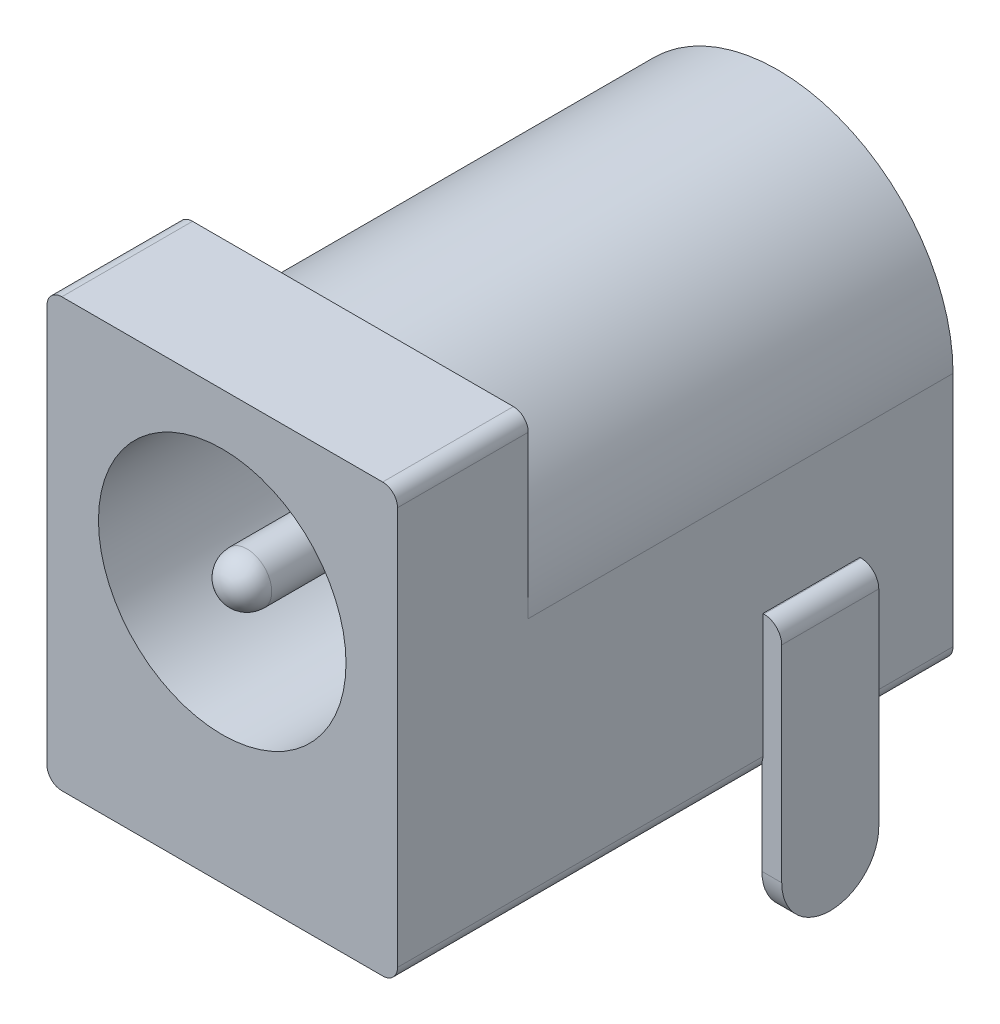
ISO-10303-21;
HEADER;
FILE_DESCRIPTION(('STEP AP214'),'2;1');
FILE_NAME('part.step','',(''),(''),'','','');
FILE_SCHEMA(('AUTOMOTIVE_DESIGN { 1 0 10303 214 1 1 1 1 }'));
ENDSEC;
DATA;
#1=APPLICATION_CONTEXT('core data for automotive mechanical design processes');
#2=APPLICATION_PROTOCOL_DEFINITION('international standard','automotive_design',2000,#1);
#3=PRODUCT_CONTEXT('',#1,'mechanical');
#4=PRODUCT('Part','Part','',(#3));
#5=PRODUCT_RELATED_PRODUCT_CATEGORY('part','',(#4));
#6=PRODUCT_DEFINITION_FORMATION('','',#4);
#7=PRODUCT_DEFINITION_CONTEXT('part definition',#1,'design');
#8=PRODUCT_DEFINITION('design','',#6,#7);
#9=PRODUCT_DEFINITION_SHAPE('','',#8);
#10=(LENGTH_UNIT() NAMED_UNIT(*) SI_UNIT(.MILLI.,.METRE.));
#11=(NAMED_UNIT(*) PLANE_ANGLE_UNIT() SI_UNIT($,.RADIAN.));
#12=(NAMED_UNIT(*) SI_UNIT($,.STERADIAN.) SOLID_ANGLE_UNIT());
#13=UNCERTAINTY_MEASURE_WITH_UNIT(LENGTH_MEASURE(1.E-05),#10,'distance_accuracy_value','');
#14=(GEOMETRIC_REPRESENTATION_CONTEXT(3) GLOBAL_UNCERTAINTY_ASSIGNED_CONTEXT((#13)) GLOBAL_UNIT_ASSIGNED_CONTEXT((#10,
#11,#12)) REPRESENTATION_CONTEXT('',''));
#15=CARTESIAN_POINT('',(0.,0.,0.));
#16=DIRECTION('',(0.,0.,1.));
#17=DIRECTION('',(1.,0.,0.));
#18=AXIS2_PLACEMENT_3D('',#15,#16,#17);
#19=CARTESIAN_POINT('',(8.9662,-3.683,2.3876));
#20=DIRECTION('',(-1.,0.,0.));
#21=DIRECTION('',(0.,0.,1.));
#22=AXIS2_PLACEMENT_3D('',#19,#20,#21);
#23=PLANE('',#22);
#24=DIRECTION('',(0.,1.,0.));
#25=VECTOR('',#24,1.);
#26=CARTESIAN_POINT('',(8.9662,-3.683,2.3876));
#27=LINE('',#26,#25);
#28=CARTESIAN_POINT('',(8.96619999999999,-2.1844,2.3876));
#29=VERTEX_POINT('',#28);
#30=CARTESIAN_POINT('',(8.9662,0.244216813898783,2.3876));
#31=VERTEX_POINT('',#30);
#32=EDGE_CURVE('E224',#29,#31,#27,.T.);
#33=ORIENTED_EDGE('',*,*,#32,.F.);
#34=CARTESIAN_POINT('',(8.96619999999999,-2.1844,3.6322));
#35=DIRECTION('',(1.,0.,0.));
#36=DIRECTION('',(0.,0.,-1.));
#37=AXIS2_PLACEMENT_3D('',#34,#35,#36);
#38=CIRCLE('',#37,1.2446);
#39=CARTESIAN_POINT('',(8.96619999999999,-2.1844,4.8768));
#40=VERTEX_POINT('',#39);
#41=EDGE_CURVE('E211',#40,#29,#38,.T.);
#42=ORIENTED_EDGE('',*,*,#41,.F.);
#43=DIRECTION('',(0.,1.,0.));
#44=VECTOR('',#43,1.);
#45=CARTESIAN_POINT('',(8.9662,-3.683,4.8768));
#46=LINE('',#45,#44);
#47=CARTESIAN_POINT('',(8.9662,0.244216813898783,4.8768));
#48=VERTEX_POINT('',#47);
#49=EDGE_CURVE('E244',#40,#48,#46,.T.);
#50=ORIENTED_EDGE('',*,*,#49,.T.);
#51=DIRECTION('',(0.,0.,-1.));
#52=VECTOR('',#51,1.);
#53=CARTESIAN_POINT('',(8.9662,0.244216813898783,14.2494));
#54=LINE('',#53,#52);
#55=EDGE_CURVE('E231',#31,#48,#54,.F.);
#56=ORIENTED_EDGE('',*,*,#55,.F.);
#57=EDGE_LOOP('',(#33,#42,#50,#56));
#58=FACE_BOUND('',#57,.T.);
#59=ADVANCED_FACE('F35',(#58),#23,.T.);
#60=CARTESIAN_POINT('',(8.9662,-3.683,2.3876));
#61=DIRECTION('',(0.,0.,1.));
#62=DIRECTION('',(1.,0.,0.));
#63=AXIS2_PLACEMENT_3D('',#60,#61,#62);
#64=PLANE('',#63);
#65=DIRECTION('',(1.,0.,0.));
#66=VECTOR('',#65,1.);
#67=CARTESIAN_POINT('',(8.96619999999999,-2.1844,2.3876));
#68=LINE('',#67,#66);
#69=CARTESIAN_POINT('',(9.47419999999999,-2.1844,2.3876));
#70=VERTEX_POINT('',#69);
#71=EDGE_CURVE('E50',#29,#70,#68,.T.);
#72=ORIENTED_EDGE('',*,*,#71,.F.);
#73=ORIENTED_EDGE('',*,*,#32,.T.);
#74=CARTESIAN_POINT('',(8.6106,0.380999999999999,2.3876));
#75=DIRECTION('',(0.,0.,1.));
#76=DIRECTION('',(1.,0.,0.));
#77=AXIS2_PLACEMENT_3D('',#74,#75,#76);
#78=CIRCLE('',#77,0.380999999999999);
#79=CARTESIAN_POINT('',(8.99159999999999,0.380999999999999,2.3876));
#80=VERTEX_POINT('',#79);
#81=EDGE_CURVE('E235',#31,#80,#78,.T.);
#82=ORIENTED_EDGE('',*,*,#81,.T.);
#83=DIRECTION('',(0.,-1.,0.));
#84=VECTOR('',#83,1.);
#85=CARTESIAN_POINT('',(8.9916,10.5918,2.3876));
#86=LINE('',#85,#84);
#87=CARTESIAN_POINT('',(8.9916,3.556,2.3876));
#88=VERTEX_POINT('',#87);
#89=EDGE_CURVE('E342',#88,#80,#86,.T.);
#90=ORIENTED_EDGE('',*,*,#89,.F.);
#91=DIRECTION('',(1.,0.,0.));
#92=VECTOR('',#91,1.);
#93=CARTESIAN_POINT('',(8.9662,3.556,2.3876));
#94=LINE('',#93,#92);
#95=CARTESIAN_POINT('',(9.017,3.556,2.3876));
#96=VERTEX_POINT('',#95);
#97=EDGE_CURVE('E240',#88,#96,#94,.T.);
#98=ORIENTED_EDGE('',*,*,#97,.T.);
#99=CARTESIAN_POINT('',(9.017,3.0988,2.3876));
#100=DIRECTION('',(0.,0.,1.));
#101=DIRECTION('',(1.,0.,0.));
#102=AXIS2_PLACEMENT_3D('',#99,#100,#101);
#103=CIRCLE('',#102,0.4572);
#104=CARTESIAN_POINT('',(9.47419999999999,3.0988,2.3876));
#105=VERTEX_POINT('',#104);
#106=EDGE_CURVE('E378',#96,#105,#103,.F.);
#107=ORIENTED_EDGE('',*,*,#106,.T.);
#108=DIRECTION('',(0.,1.,0.));
#109=VECTOR('',#108,1.);
#110=CARTESIAN_POINT('',(9.47419999999999,-3.683,2.3876));
#111=LINE('',#110,#109);
#112=EDGE_CURVE('E227',#70,#105,#111,.T.);
#113=ORIENTED_EDGE('',*,*,#112,.F.);
#114=EDGE_LOOP('',(#72,#73,#82,#90,#98,#107,#113));
#115=FACE_BOUND('',#114,.T.);
#116=ADVANCED_FACE('F222',(#115),#64,.F.);
#117=CARTESIAN_POINT('',(9.47419999999999,-3.683,4.8768));
#118=DIRECTION('',(1.,0.,0.));
#119=DIRECTION('',(0.,0.,-1.));
#120=AXIS2_PLACEMENT_3D('',#117,#118,#119);
#121=PLANE('',#120);
#122=DIRECTION('',(0.,1.,0.));
#123=VECTOR('',#122,1.);
#124=CARTESIAN_POINT('',(9.47419999999999,-3.683,4.8768));
#125=LINE('',#124,#123);
#126=CARTESIAN_POINT('',(9.47419999999999,-2.1844,4.8768));
#127=VERTEX_POINT('',#126);
#128=CARTESIAN_POINT('',(9.47419999999999,3.0988,4.8768));
#129=VERTEX_POINT('',#128);
#130=EDGE_CURVE('E237',#127,#129,#125,.T.);
#131=ORIENTED_EDGE('',*,*,#130,.F.);
#132=CARTESIAN_POINT('',(9.47419999999999,-2.1844,3.6322));
#133=DIRECTION('',(1.,0.,0.));
#134=DIRECTION('',(0.,0.,-1.));
#135=AXIS2_PLACEMENT_3D('',#132,#133,#134);
#136=CIRCLE('',#135,1.2446);
#137=EDGE_CURVE('E218',#127,#70,#136,.T.);
#138=ORIENTED_EDGE('',*,*,#137,.T.);
#139=ORIENTED_EDGE('',*,*,#112,.T.);
#140=DIRECTION('',(0.,0.,-1.));
#141=VECTOR('',#140,1.);
#142=CARTESIAN_POINT('',(9.47419999999999,3.0988,4.8768));
#143=LINE('',#142,#141);
#144=EDGE_CURVE('E380',#105,#129,#143,.F.);
#145=ORIENTED_EDGE('',*,*,#144,.T.);
#146=EDGE_LOOP('',(#131,#138,#139,#145));
#147=FACE_BOUND('',#146,.T.);
#148=ADVANCED_FACE('F439',(#147),#121,.T.);
#149=CARTESIAN_POINT('',(5.7404,-3.683,7.0104));
#150=DIRECTION('',(1.,0.,0.));
#151=DIRECTION('',(0.,0.,-1.));
#152=AXIS2_PLACEMENT_3D('',#149,#150,#151);
#153=PLANE('',#152);
#154=DIRECTION('',(0.,1.,0.));
#155=VECTOR('',#154,1.);
#156=CARTESIAN_POINT('',(5.7404,-3.683,7.0104));
#157=LINE('',#156,#155);
#158=CARTESIAN_POINT('',(5.7404,-2.1844,7.0104));
#159=VERTEX_POINT('',#158);
#160=CARTESIAN_POINT('',(5.7404,0.,7.0104));
#161=VERTEX_POINT('',#160);
#162=EDGE_CURVE('E469',#159,#161,#157,.T.);
#163=ORIENTED_EDGE('',*,*,#162,.F.);
#164=DIRECTION('',(0.,0.,-1.));
#165=VECTOR('',#164,1.);
#166=CARTESIAN_POINT('',(5.7404,-2.1844,7.26440000002886));
#167=LINE('',#166,#165);
#168=CARTESIAN_POINT('',(5.7404,-2.1844,6.75640000002886));
#169=VERTEX_POINT('',#168);
#170=EDGE_CURVE('E57',#159,#169,#167,.T.);
#171=ORIENTED_EDGE('',*,*,#170,.T.);
#172=DIRECTION('',(0.,1.,0.));
#173=VECTOR('',#172,1.);
#174=CARTESIAN_POINT('',(5.7404,-3.683,6.7564));
#175=LINE('',#174,#173);
#176=CARTESIAN_POINT('',(5.7404,0.,6.7564));
#177=VERTEX_POINT('',#176);
#178=EDGE_CURVE('E467',#169,#177,#175,.T.);
#179=ORIENTED_EDGE('',*,*,#178,.T.);
#180=DIRECTION('',(0.,0.,-1.));
#181=VECTOR('',#180,1.);
#182=CARTESIAN_POINT('',(5.74040000000005,0.,14.2494));
#183=LINE('',#182,#181);
#184=EDGE_CURVE('E369',#161,#177,#183,.T.);
#185=ORIENTED_EDGE('',*,*,#184,.F.);
#186=EDGE_LOOP('',(#163,#171,#179,#185));
#187=FACE_BOUND('',#186,.T.);
#188=ADVANCED_FACE('F601',(#187),#153,.T.);
#189=CARTESIAN_POINT('',(3.2512,-3.683,6.7564));
#190=DIRECTION('',(0.,0.,1.));
#191=DIRECTION('',(1.,0.,0.));
#192=AXIS2_PLACEMENT_3D('',#189,#190,#191);
#193=PLANE('',#192);
#194=CARTESIAN_POINT('',(4.4958,-2.1844,6.75640000002886));
#195=DIRECTION('',(0.,0.,-1.));
#196=DIRECTION('',(-1.,0.,0.));
#197=AXIS2_PLACEMENT_3D('',#194,#195,#196);
#198=CIRCLE('',#197,1.2446);
#199=CARTESIAN_POINT('',(3.2512,-2.1844,6.75640000002886));
#200=VERTEX_POINT('',#199);
#201=EDGE_CURVE('E436',#169,#200,#198,.T.);
#202=ORIENTED_EDGE('',*,*,#201,.T.);
#203=DIRECTION('',(0.,1.,0.));
#204=VECTOR('',#203,1.);
#205=CARTESIAN_POINT('',(3.2512,-3.683,6.7564));
#206=LINE('',#205,#204);
#207=CARTESIAN_POINT('',(3.2512,0.,6.7564));
#208=VERTEX_POINT('',#207);
#209=EDGE_CURVE('E464',#200,#208,#206,.T.);
#210=ORIENTED_EDGE('',*,*,#209,.T.);
#211=DIRECTION('',(1.,0.,0.));
#212=VECTOR('',#211,1.);
#213=CARTESIAN_POINT('',(0.381,0.,6.7564));
#214=LINE('',#213,#212);
#215=EDGE_CURVE('E474',#208,#177,#214,.T.);
#216=ORIENTED_EDGE('',*,*,#215,.T.);
#217=ORIENTED_EDGE('',*,*,#178,.F.);
#218=EDGE_LOOP('',(#202,#210,#216,#217));
#219=FACE_BOUND('',#218,.T.);
#220=ADVANCED_FACE('F590',(#219),#193,.F.);
#221=CARTESIAN_POINT('',(5.7404,-3.683,7.0104));
#222=DIRECTION('',(0.,0.,-1.));
#223=DIRECTION('',(-1.,0.,0.));
#224=AXIS2_PLACEMENT_3D('',#221,#222,#223);
#225=PLANE('',#224);
#226=CARTESIAN_POINT('',(4.4958,-2.1844,7.0104));
#227=DIRECTION('',(0.,0.,-1.));
#228=DIRECTION('',(-1.,0.,0.));
#229=AXIS2_PLACEMENT_3D('',#226,#227,#228);
#230=CIRCLE('',#229,1.2446);
#231=CARTESIAN_POINT('',(3.2512,-2.1844,7.0104));
#232=VERTEX_POINT('',#231);
#233=EDGE_CURVE('E12',#159,#232,#230,.T.);
#234=ORIENTED_EDGE('',*,*,#233,.F.);
#235=ORIENTED_EDGE('',*,*,#162,.T.);
#236=DIRECTION('',(-1.,0.,0.));
#237=VECTOR('',#236,1.);
#238=CARTESIAN_POINT('',(0.381,0.,7.0104));
#239=LINE('',#238,#237);
#240=CARTESIAN_POINT('',(3.2512,0.,7.0104));
#241=VERTEX_POINT('',#240);
#242=EDGE_CURVE('E466',#161,#241,#239,.T.);
#243=ORIENTED_EDGE('',*,*,#242,.T.);
#244=DIRECTION('',(0.,1.,0.));
#245=VECTOR('',#244,1.);
#246=CARTESIAN_POINT('',(3.2512,-3.683,7.0104));
#247=LINE('',#246,#245);
#248=EDGE_CURVE('E463',#232,#241,#247,.T.);
#249=ORIENTED_EDGE('',*,*,#248,.F.);
#250=EDGE_LOOP('',(#234,#235,#243,#249));
#251=FACE_BOUND('',#250,.T.);
#252=ADVANCED_FACE('F598',(#251),#225,.F.);
#253=CARTESIAN_POINT('',(2.9972,-3.683,0.381000000000002));
#254=DIRECTION('',(0.,0.,1.));
#255=DIRECTION('',(1.,0.,0.));
#256=AXIS2_PLACEMENT_3D('',#253,#254,#255);
#257=PLANE('',#256);
#258=CARTESIAN_POINT('',(4.4958,-1.9304,0.381000000000002));
#259=DIRECTION('',(0.,0.,-1.));
#260=DIRECTION('',(-1.,0.,0.));
#261=AXIS2_PLACEMENT_3D('',#258,#259,#260);
#262=CIRCLE('',#261,1.4986);
#263=CARTESIAN_POINT('',(5.9944,-1.9304,0.381000000000002));
#264=VERTEX_POINT('',#263);
#265=CARTESIAN_POINT('',(2.9972,-1.9304,0.381000000000002));
#266=VERTEX_POINT('',#265);
#267=EDGE_CURVE('E447',#264,#266,#262,.T.);
#268=ORIENTED_EDGE('',*,*,#267,.T.);
#269=DIRECTION('',(0.,1.,0.));
#270=VECTOR('',#269,1.);
#271=CARTESIAN_POINT('',(2.9972,-3.683,0.381000000000002));
#272=LINE('',#271,#270);
#273=CARTESIAN_POINT('',(2.9972,0.,0.381000000000002));
#274=VERTEX_POINT('',#273);
#275=EDGE_CURVE('E396',#266,#274,#272,.T.);
#276=ORIENTED_EDGE('',*,*,#275,.T.);
#277=DIRECTION('',(1.,0.,0.));
#278=VECTOR('',#277,1.);
#279=CARTESIAN_POINT('',(0.381,0.,0.381000000000002));
#280=LINE('',#279,#278);
#281=CARTESIAN_POINT('',(5.9944,0.,0.381000000000002));
#282=VERTEX_POINT('',#281);
#283=EDGE_CURVE('E351',#274,#282,#280,.T.);
#284=ORIENTED_EDGE('',*,*,#283,.T.);
#285=DIRECTION('',(0.,1.,0.));
#286=VECTOR('',#285,1.);
#287=CARTESIAN_POINT('',(5.9944,-3.683,0.381000000000002));
#288=LINE('',#287,#286);
#289=EDGE_CURVE('E479',#264,#282,#288,.T.);
#290=ORIENTED_EDGE('',*,*,#289,.F.);
#291=EDGE_LOOP('',(#268,#276,#284,#290));
#292=FACE_BOUND('',#291,.T.);
#293=ADVANCED_FACE('F503',(#292),#257,.F.);
#294=CARTESIAN_POINT('',(5.9944,-3.683,0.889000000000002));
#295=DIRECTION('',(1.,0.,0.));
#296=DIRECTION('',(0.,0.,-1.));
#297=AXIS2_PLACEMENT_3D('',#294,#295,#296);
#298=PLANE('',#297);
#299=DIRECTION('',(0.,1.,0.));
#300=VECTOR('',#299,1.);
#301=CARTESIAN_POINT('',(5.9944,-3.683,0.889000000000002));
#302=LINE('',#301,#300);
#303=CARTESIAN_POINT('',(5.9944,-1.9304,0.889000000000002));
#304=VERTEX_POINT('',#303);
#305=CARTESIAN_POINT('',(5.9944,0.,0.889000000000002));
#306=VERTEX_POINT('',#305);
#307=EDGE_CURVE('E481',#304,#306,#302,.T.);
#308=ORIENTED_EDGE('',*,*,#307,.F.);
#309=DIRECTION('',(0.,0.,-1.));
#310=VECTOR('',#309,1.);
#311=CARTESIAN_POINT('',(5.9944,-1.9304,0.889000000000003));
#312=LINE('',#311,#310);
#313=EDGE_CURVE('E450',#304,#264,#312,.T.);
#314=ORIENTED_EDGE('',*,*,#313,.T.);
#315=ORIENTED_EDGE('',*,*,#289,.T.);
#316=DIRECTION('',(0.,0.,-1.));
#317=VECTOR('',#316,1.);
#318=CARTESIAN_POINT('',(5.9944,0.,14.2494));
#319=LINE('',#318,#317);
#320=EDGE_CURVE('E348',#306,#282,#319,.T.);
#321=ORIENTED_EDGE('',*,*,#320,.F.);
#322=EDGE_LOOP('',(#308,#314,#315,#321));
#323=FACE_BOUND('',#322,.T.);
#324=ADVANCED_FACE('F500',(#323),#298,.T.);
#325=CARTESIAN_POINT('',(5.9944,-3.683,0.889000000000002));
#326=DIRECTION('',(0.,0.,-1.));
#327=DIRECTION('',(-1.,0.,0.));
#328=AXIS2_PLACEMENT_3D('',#325,#326,#327);
#329=PLANE('',#328);
#330=CARTESIAN_POINT('',(4.4958,-1.9304,0.889000000000003));
#331=DIRECTION('',(0.,0.,-1.));
#332=DIRECTION('',(-1.,0.,0.));
#333=AXIS2_PLACEMENT_3D('',#330,#331,#332);
#334=CIRCLE('',#333,1.4986);
#335=CARTESIAN_POINT('',(2.9972,-1.9304,0.889000000000003));
#336=VERTEX_POINT('',#335);
#337=EDGE_CURVE('E448',#304,#336,#334,.T.);
#338=ORIENTED_EDGE('',*,*,#337,.F.);
#339=ORIENTED_EDGE('',*,*,#307,.T.);
#340=DIRECTION('',(-1.,0.,0.));
#341=VECTOR('',#340,1.);
#342=CARTESIAN_POINT('',(0.380999999999999,0.,0.889000000000003));
#343=LINE('',#342,#341);
#344=CARTESIAN_POINT('',(2.9972,0.,0.889000000000003));
#345=VERTEX_POINT('',#344);
#346=EDGE_CURVE('E345',#306,#345,#343,.T.);
#347=ORIENTED_EDGE('',*,*,#346,.T.);
#348=DIRECTION('',(0.,1.,0.));
#349=VECTOR('',#348,1.);
#350=CARTESIAN_POINT('',(2.9972,-3.683,0.889000000000003));
#351=LINE('',#350,#349);
#352=EDGE_CURVE('E477',#336,#345,#351,.T.);
#353=ORIENTED_EDGE('',*,*,#352,.F.);
#354=EDGE_LOOP('',(#338,#339,#347,#353));
#355=FACE_BOUND('',#354,.T.);
#356=ADVANCED_FACE('F497',(#355),#329,.F.);
#357=CARTESIAN_POINT('',(4.4958,6.477,2.54));
#358=DIRECTION('',(0.,0.,1.));
#359=DIRECTION('',(1.,0.,0.));
#360=AXIS2_PLACEMENT_3D('',#357,#358,#359);
#361=CYLINDRICAL_SURFACE('',#360,3.175);
#362=CARTESIAN_POINT('',(4.4958,6.477,14.2494));
#363=DIRECTION('',(0.,0.,1.));
#364=DIRECTION('',(1.,0.,0.));
#365=AXIS2_PLACEMENT_3D('',#362,#363,#364);
#366=CIRCLE('',#365,3.175);
#367=CARTESIAN_POINT('',(7.6708,6.477,14.2494));
#368=VERTEX_POINT('',#367);
#369=EDGE_CURVE('E271',#368,#368,#366,.T.);
#370=ORIENTED_EDGE('',*,*,#369,.T.);
#371=EDGE_LOOP('',(#370));
#372=FACE_BOUND('',#371,.T.);
#373=CARTESIAN_POINT('',(4.4958,6.477,2.54));
#374=DIRECTION('',(0.,0.,1.));
#375=DIRECTION('',(1.,0.,0.));
#376=AXIS2_PLACEMENT_3D('',#373,#374,#375);
#377=CIRCLE('',#376,3.175);
#378=CARTESIAN_POINT('',(7.6708,6.477,2.54));
#379=VERTEX_POINT('',#378);
#380=EDGE_CURVE('E272',#379,#379,#377,.T.);
#381=ORIENTED_EDGE('',*,*,#380,.F.);
#382=EDGE_LOOP('',(#381));
#383=FACE_BOUND('',#382,.T.);
#384=DIRECTION('',(0.,0.,1.));
#385=VECTOR('',#384,1.);
#386=CARTESIAN_POINT('',(5.74014078933385,3.556,2.54));
#387=LINE('',#386,#385);
#388=CARTESIAN_POINT('',(5.74014078933385,3.556,7.0104));
#389=VERTEX_POINT('',#388);
#390=CARTESIAN_POINT('',(5.74014078933385,3.556,6.7564));
#391=VERTEX_POINT('',#390);
#392=EDGE_CURVE('E366',#389,#391,#387,.F.);
#393=ORIENTED_EDGE('',*,*,#392,.F.);
#394=CARTESIAN_POINT('',(4.4958,6.477,7.0104));
#395=DIRECTION('',(0.,0.,-1.));
#396=DIRECTION('',(-1.,0.,0.));
#397=AXIS2_PLACEMENT_3D('',#394,#395,#396);
#398=CIRCLE('',#397,3.175);
#399=CARTESIAN_POINT('',(3.25145921066615,3.556,7.0104));
#400=VERTEX_POINT('',#399);
#401=EDGE_CURVE('E360',#400,#389,#398,.F.);
#402=ORIENTED_EDGE('',*,*,#401,.F.);
#403=DIRECTION('',(0.,0.,1.));
#404=VECTOR('',#403,1.);
#405=CARTESIAN_POINT('',(3.25145921066615,3.556,2.54));
#406=LINE('',#405,#404);
#407=CARTESIAN_POINT('',(3.25145921066615,3.556,6.7564));
#408=VERTEX_POINT('',#407);
#409=EDGE_CURVE('E357',#408,#400,#406,.T.);
#410=ORIENTED_EDGE('',*,*,#409,.F.);
#411=CARTESIAN_POINT('',(4.4958,6.477,6.7564));
#412=DIRECTION('',(0.,0.,1.));
#413=DIRECTION('',(1.,0.,0.));
#414=AXIS2_PLACEMENT_3D('',#411,#412,#413);
#415=CIRCLE('',#414,3.175);
#416=EDGE_CURVE('E363',#391,#408,#415,.F.);
#417=ORIENTED_EDGE('',*,*,#416,.F.);
#418=EDGE_LOOP('',(#393,#402,#410,#417));
#419=FACE_BOUND('',#418,.T.);
#420=ADVANCED_FACE('F538',(#372,#383,#419),#361,.F.);
#421=CARTESIAN_POINT('',(8.6106,0.380999999999999,14.2494));
#422=DIRECTION('',(0.,0.,-1.));
#423=DIRECTION('',(-1.,0.,0.));
#424=AXIS2_PLACEMENT_3D('',#421,#422,#423);
#425=CYLINDRICAL_SURFACE('',#424,0.380999999999999);
#426=ORIENTED_EDGE('',*,*,#81,.F.);
#427=ORIENTED_EDGE('',*,*,#55,.T.);
#428=CARTESIAN_POINT('',(8.6106,0.380999999999999,4.8768));
#429=DIRECTION('',(0.,0.,-1.));
#430=DIRECTION('',(-1.,0.,0.));
#431=AXIS2_PLACEMENT_3D('',#428,#429,#430);
#432=CIRCLE('',#431,0.380999999999999);
#433=CARTESIAN_POINT('',(8.99159999999999,0.380999999999999,4.8768));
#434=VERTEX_POINT('',#433);
#435=EDGE_CURVE('E232',#434,#48,#432,.T.);
#436=ORIENTED_EDGE('',*,*,#435,.F.);
#437=DIRECTION('',(0.,0.,-1.));
#438=VECTOR('',#437,1.);
#439=CARTESIAN_POINT('',(8.99159999999999,0.380999999999999,14.2494));
#440=LINE('',#439,#438);
#441=CARTESIAN_POINT('',(8.99159999999999,0.380999999999999,14.2494));
#442=VERTEX_POINT('',#441);
#443=EDGE_CURVE('E320',#442,#434,#440,.T.);
#444=ORIENTED_EDGE('',*,*,#443,.F.);
#445=CARTESIAN_POINT('',(8.6106,0.380999999999999,14.2494));
#446=DIRECTION('',(0.,0.,1.));
#447=DIRECTION('',(1.,0.,0.));
#448=AXIS2_PLACEMENT_3D('',#445,#446,#447);
#449=CIRCLE('',#448,0.380999999999999);
#450=CARTESIAN_POINT('',(8.6106,0.,14.2494));
#451=VERTEX_POINT('',#450);
#452=EDGE_CURVE('E289',#451,#442,#449,.T.);
#453=ORIENTED_EDGE('',*,*,#452,.F.);
#454=DIRECTION('',(0.,0.,-1.));
#455=VECTOR('',#454,1.);
#456=CARTESIAN_POINT('',(8.6106,0.,14.2494));
#457=LINE('',#456,#455);
#458=CARTESIAN_POINT('',(8.6106,0.,0.));
#459=VERTEX_POINT('',#458);
#460=EDGE_CURVE('E323',#451,#459,#457,.T.);
#461=ORIENTED_EDGE('',*,*,#460,.T.);
#462=CARTESIAN_POINT('',(8.6106,0.380999999999999,0.));
#463=DIRECTION('',(0.,0.,1.));
#464=DIRECTION('',(1.,0.,0.));
#465=AXIS2_PLACEMENT_3D('',#462,#463,#464);
#466=CIRCLE('',#465,0.380999999999999);
#467=CARTESIAN_POINT('',(8.99159999999999,0.380999999999999,0.));
#468=VERTEX_POINT('',#467);
#469=EDGE_CURVE('E306',#459,#468,#466,.T.);
#470=ORIENTED_EDGE('',*,*,#469,.T.);
#471=EDGE_CURVE('E319',#80,#468,#440,.T.);
#472=ORIENTED_EDGE('',*,*,#471,.F.);
#473=EDGE_LOOP('',(#426,#427,#436,#444,#453,#461,#470,#472));
#474=FACE_BOUND('',#473,.T.);
#475=ADVANCED_FACE('F403',(#474),#425,.T.);
#476=CARTESIAN_POINT('',(8.9916,10.5918,14.2494));
#477=DIRECTION('',(1.,0.,0.));
#478=DIRECTION('',(0.,1.,0.));
#479=AXIS2_PLACEMENT_3D('',#476,#477,#478);
#480=PLANE('',#479);
#481=DIRECTION('',(0.,0.,1.));
#482=VECTOR('',#481,1.);
#483=CARTESIAN_POINT('',(8.9916,3.556,14.2494));
#484=LINE('',#483,#482);
#485=CARTESIAN_POINT('',(8.9916,3.556,4.8768));
#486=VERTEX_POINT('',#485);
#487=EDGE_CURVE('E336',#88,#486,#484,.T.);
#488=ORIENTED_EDGE('',*,*,#487,.F.);
#489=ORIENTED_EDGE('',*,*,#89,.T.);
#490=ORIENTED_EDGE('',*,*,#471,.T.);
#491=DIRECTION('',(0.,-1.,0.));
#492=VECTOR('',#491,1.);
#493=CARTESIAN_POINT('',(8.9916,10.5918,0.));
#494=LINE('',#493,#492);
#495=CARTESIAN_POINT('',(8.9916,6.4516,0.));
#496=VERTEX_POINT('',#495);
#497=EDGE_CURVE('E281',#496,#468,#494,.T.);
#498=ORIENTED_EDGE('',*,*,#497,.F.);
#499=DIRECTION('',(0.,0.,-1.));
#500=VECTOR('',#499,1.);
#501=CARTESIAN_POINT('',(8.9916,6.4516,24.3136992801287));
#502=LINE('',#501,#500);
#503=CARTESIAN_POINT('',(8.9916,6.4516,10.8966));
#504=VERTEX_POINT('',#503);
#505=EDGE_CURVE('E260',#504,#496,#502,.T.);
#506=ORIENTED_EDGE('',*,*,#505,.F.);
#507=DIRECTION('',(0.,-1.,0.));
#508=VECTOR('',#507,1.);
#509=CARTESIAN_POINT('',(8.9916,10.5918,10.8966));
#510=LINE('',#509,#508);
#511=CARTESIAN_POINT('',(8.9916,10.5918,10.8966));
#512=VERTEX_POINT('',#511);
#513=EDGE_CURVE('E257',#512,#504,#510,.T.);
#514=ORIENTED_EDGE('',*,*,#513,.F.);
#515=DIRECTION('',(0.,0.,-1.));
#516=VECTOR('',#515,1.);
#517=CARTESIAN_POINT('',(8.9916,10.5918,14.2494));
#518=LINE('',#517,#516);
#519=CARTESIAN_POINT('',(8.9916,10.5918,14.2494));
#520=VERTEX_POINT('',#519);
#521=EDGE_CURVE('E316',#520,#512,#518,.T.);
#522=ORIENTED_EDGE('',*,*,#521,.F.);
#523=DIRECTION('',(0.,-1.,0.));
#524=VECTOR('',#523,1.);
#525=CARTESIAN_POINT('',(8.9916,10.5918,14.2494));
#526=LINE('',#525,#524);
#527=EDGE_CURVE('E291',#520,#442,#526,.T.);
#528=ORIENTED_EDGE('',*,*,#527,.T.);
#529=ORIENTED_EDGE('',*,*,#443,.T.);
#530=DIRECTION('',(0.,1.,0.));
#531=VECTOR('',#530,1.);
#532=CARTESIAN_POINT('',(8.9916,10.5918,4.8768));
#533=LINE('',#532,#531);
#534=EDGE_CURVE('E339',#434,#486,#533,.T.);
#535=ORIENTED_EDGE('',*,*,#534,.T.);
#536=EDGE_LOOP('',(#488,#489,#490,#498,#506,#514,#522,#528,#529,#535));
#537=FACE_BOUND('',#536,.T.);
#538=ADVANCED_FACE('F400',(#537),#480,.T.);
#539=CARTESIAN_POINT('',(0.381,10.5918,0.));
#540=DIRECTION('',(0.,0.,1.));
#541=DIRECTION('',(1.,0.,0.));
#542=AXIS2_PLACEMENT_3D('',#539,#540,#541);
#543=PLANE('',#542);
#544=CARTESIAN_POINT('',(4.4958,6.4516,0.));
#545=DIRECTION('',(0.,0.,-1.));
#546=DIRECTION('',(-1.,0.,0.));
#547=AXIS2_PLACEMENT_3D('',#544,#545,#546);
#548=CIRCLE('',#547,4.4958);
#549=CARTESIAN_POINT('',(0.,6.4516,0.));
#550=VERTEX_POINT('',#549);
#551=EDGE_CURVE('E248',#550,#496,#548,.T.);
#552=ORIENTED_EDGE('',*,*,#551,.T.);
#553=ORIENTED_EDGE('',*,*,#497,.T.);
#554=ORIENTED_EDGE('',*,*,#469,.F.);
#555=DIRECTION('',(1.,0.,0.));
#556=VECTOR('',#555,1.);
#557=CARTESIAN_POINT('',(0.381,0.,0.));
#558=LINE('',#557,#556);
#559=CARTESIAN_POINT('',(0.381,0.,0.));
#560=VERTEX_POINT('',#559);
#561=EDGE_CURVE('E304',#560,#459,#558,.T.);
#562=ORIENTED_EDGE('',*,*,#561,.F.);
#563=CARTESIAN_POINT('',(0.381,0.381,0.));
#564=DIRECTION('',(0.,0.,-1.));
#565=DIRECTION('',(-1.,0.,0.));
#566=AXIS2_PLACEMENT_3D('',#563,#564,#565);
#567=CIRCLE('',#566,0.381);
#568=CARTESIAN_POINT('',(0.,0.381,0.));
#569=VERTEX_POINT('',#568);
#570=EDGE_CURVE('E301',#560,#569,#567,.T.);
#571=ORIENTED_EDGE('',*,*,#570,.T.);
#572=DIRECTION('',(0.,1.,0.));
#573=VECTOR('',#572,1.);
#574=CARTESIAN_POINT('',(0.,0.381,0.));
#575=LINE('',#574,#573);
#576=EDGE_CURVE('E275',#569,#550,#575,.T.);
#577=ORIENTED_EDGE('',*,*,#576,.T.);
#578=EDGE_LOOP('',(#552,#553,#554,#562,#571,#577));
#579=FACE_BOUND('',#578,.T.);
#580=ADVANCED_FACE('F409',(#579),#543,.F.);
#581=CARTESIAN_POINT('',(0.381,10.5918,14.2494));
#582=DIRECTION('',(0.,0.,-1.));
#583=DIRECTION('',(-1.,0.,0.));
#584=AXIS2_PLACEMENT_3D('',#581,#582,#583);
#585=CYLINDRICAL_SURFACE('',#584,0.381);
#586=DIRECTION('',(0.,0.,-1.));
#587=VECTOR('',#586,1.);
#588=CARTESIAN_POINT('',(0.381,10.9728,14.2494));
#589=LINE('',#588,#587);
#590=CARTESIAN_POINT('',(0.381,10.9728,14.2494));
#591=VERTEX_POINT('',#590);
#592=CARTESIAN_POINT('',(0.381,10.9728,10.8966));
#593=VERTEX_POINT('',#592);
#594=EDGE_CURVE('E298',#591,#593,#589,.T.);
#595=ORIENTED_EDGE('',*,*,#594,.T.);
#596=CARTESIAN_POINT('',(0.381,10.5918,10.8966));
#597=DIRECTION('',(0.,0.,1.));
#598=DIRECTION('',(1.,0.,0.));
#599=AXIS2_PLACEMENT_3D('',#596,#597,#598);
#600=CIRCLE('',#599,0.381);
#601=CARTESIAN_POINT('',(0.,10.5918,10.8966));
#602=VERTEX_POINT('',#601);
#603=EDGE_CURVE('E255',#602,#593,#600,.F.);
#604=ORIENTED_EDGE('',*,*,#603,.F.);
#605=DIRECTION('',(0.,0.,-1.));
#606=VECTOR('',#605,1.);
#607=CARTESIAN_POINT('',(0.,10.5918,14.2494));
#608=LINE('',#607,#606);
#609=CARTESIAN_POINT('',(0.,10.5918,14.2494));
#610=VERTEX_POINT('',#609);
#611=EDGE_CURVE('E330',#610,#602,#608,.T.);
#612=ORIENTED_EDGE('',*,*,#611,.F.);
#613=CARTESIAN_POINT('',(0.381,10.5918,14.2494));
#614=DIRECTION('',(0.,0.,1.));
#615=DIRECTION('',(1.,0.,0.));
#616=AXIS2_PLACEMENT_3D('',#613,#614,#615);
#617=CIRCLE('',#616,0.381);
#618=EDGE_CURVE('E278',#591,#610,#617,.T.);
#619=ORIENTED_EDGE('',*,*,#618,.F.);
#620=EDGE_LOOP('',(#595,#604,#612,#619));
#621=FACE_BOUND('',#620,.T.);
#622=ADVANCED_FACE('F547',(#621),#585,.T.);
#623=CARTESIAN_POINT('',(0.,0.381,14.2494));
#624=DIRECTION('',(-1.,0.,0.));
#625=DIRECTION('',(0.,-1.,0.));
#626=AXIS2_PLACEMENT_3D('',#623,#624,#625);
#627=PLANE('',#626);
#628=DIRECTION('',(0.,1.,0.));
#629=VECTOR('',#628,1.);
#630=CARTESIAN_POINT('',(0.,6.4516,10.8966));
#631=LINE('',#630,#629);
#632=CARTESIAN_POINT('',(0.,6.4516,10.8966));
#633=VERTEX_POINT('',#632);
#634=EDGE_CURVE('E253',#633,#602,#631,.T.);
#635=ORIENTED_EDGE('',*,*,#634,.F.);
#636=DIRECTION('',(0.,0.,-1.));
#637=VECTOR('',#636,1.);
#638=CARTESIAN_POINT('',(0.,6.4516,24.3136992801287));
#639=LINE('',#638,#637);
#640=EDGE_CURVE('E252',#633,#550,#639,.T.);
#641=ORIENTED_EDGE('',*,*,#640,.T.);
#642=ORIENTED_EDGE('',*,*,#576,.F.);
#643=DIRECTION('',(0.,0.,-1.));
#644=VECTOR('',#643,1.);
#645=CARTESIAN_POINT('',(0.,0.381,14.2494));
#646=LINE('',#645,#644);
#647=CARTESIAN_POINT('',(0.,0.381,14.2494));
#648=VERTEX_POINT('',#647);
#649=EDGE_CURVE('E328',#648,#569,#646,.T.);
#650=ORIENTED_EDGE('',*,*,#649,.F.);
#651=DIRECTION('',(0.,1.,0.));
#652=VECTOR('',#651,1.);
#653=CARTESIAN_POINT('',(0.,0.381,14.2494));
#654=LINE('',#653,#652);
#655=EDGE_CURVE('E280',#648,#610,#654,.T.);
#656=ORIENTED_EDGE('',*,*,#655,.T.);
#657=ORIENTED_EDGE('',*,*,#611,.T.);
#658=EDGE_LOOP('',(#635,#641,#642,#650,#656,#657));
#659=FACE_BOUND('',#658,.T.);
#660=ADVANCED_FACE('F562',(#659),#627,.T.);
#661=CARTESIAN_POINT('',(0.381,0.381,14.2494));
#662=DIRECTION('',(0.,0.,-1.));
#663=DIRECTION('',(-1.,0.,0.));
#664=AXIS2_PLACEMENT_3D('',#661,#662,#663);
#665=CYLINDRICAL_SURFACE('',#664,0.381);
#666=ORIENTED_EDGE('',*,*,#570,.F.);
#667=DIRECTION('',(0.,0.,-1.));
#668=VECTOR('',#667,1.);
#669=CARTESIAN_POINT('',(0.381,0.,14.2494));
#670=LINE('',#669,#668);
#671=CARTESIAN_POINT('',(0.381,0.,14.2494));
#672=VERTEX_POINT('',#671);
#673=EDGE_CURVE('E326',#672,#560,#670,.T.);
#674=ORIENTED_EDGE('',*,*,#673,.F.);
#675=CARTESIAN_POINT('',(0.381,0.381,14.2494));
#676=DIRECTION('',(0.,0.,-1.));
#677=DIRECTION('',(-1.,0.,0.));
#678=AXIS2_PLACEMENT_3D('',#675,#676,#677);
#679=CIRCLE('',#678,0.381);
#680=EDGE_CURVE('E284',#672,#648,#679,.T.);
#681=ORIENTED_EDGE('',*,*,#680,.T.);
#682=ORIENTED_EDGE('',*,*,#649,.T.);
#683=EDGE_LOOP('',(#666,#674,#681,#682));
#684=FACE_BOUND('',#683,.T.);
#685=ADVANCED_FACE('F558',(#684),#665,.T.);
#686=CARTESIAN_POINT('',(0.381,0.,14.2494));
#687=DIRECTION('',(0.,1.,0.));
#688=DIRECTION('',(0.,0.,1.));
#689=AXIS2_PLACEMENT_3D('',#686,#687,#688);
#690=PLANE('',#689);
#691=ORIENTED_EDGE('',*,*,#215,.F.);
#692=DIRECTION('',(0.,0.,1.));
#693=VECTOR('',#692,1.);
#694=CARTESIAN_POINT('',(3.25120000000001,0.,14.2494));
#695=LINE('',#694,#693);
#696=EDGE_CURVE('E372',#208,#241,#695,.T.);
#697=ORIENTED_EDGE('',*,*,#696,.T.);
#698=ORIENTED_EDGE('',*,*,#242,.F.);
#699=ORIENTED_EDGE('',*,*,#184,.T.);
#700=EDGE_LOOP('',(#691,#697,#698,#699));
#701=FACE_BOUND('',#700,.T.);
#702=ORIENTED_EDGE('',*,*,#283,.F.);
#703=DIRECTION('',(0.,0.,1.));
#704=VECTOR('',#703,1.);
#705=CARTESIAN_POINT('',(2.9972,0.,14.2494));
#706=LINE('',#705,#704);
#707=EDGE_CURVE('E354',#274,#345,#706,.T.);
#708=ORIENTED_EDGE('',*,*,#707,.T.);
#709=ORIENTED_EDGE('',*,*,#346,.F.);
#710=ORIENTED_EDGE('',*,*,#320,.T.);
#711=EDGE_LOOP('',(#702,#708,#709,#710));
#712=FACE_BOUND('',#711,.T.);
#713=ORIENTED_EDGE('',*,*,#561,.T.);
#714=ORIENTED_EDGE('',*,*,#460,.F.);
#715=DIRECTION('',(1.,0.,0.));
#716=VECTOR('',#715,1.);
#717=CARTESIAN_POINT('',(0.381,0.,14.2494));
#718=LINE('',#717,#716);
#719=EDGE_CURVE('E287',#672,#451,#718,.T.);
#720=ORIENTED_EDGE('',*,*,#719,.F.);
#721=ORIENTED_EDGE('',*,*,#673,.T.);
#722=EDGE_LOOP('',(#713,#714,#720,#721));
#723=FACE_BOUND('',#722,.T.);
#724=ADVANCED_FACE('F494',(#701,#712,#723),#690,.F.);
#725=CARTESIAN_POINT('',(8.6106,10.5918,14.2494));
#726=DIRECTION('',(0.,0.,-1.));
#727=DIRECTION('',(-1.,0.,0.));
#728=AXIS2_PLACEMENT_3D('',#725,#726,#727);
#729=CYLINDRICAL_SURFACE('',#728,0.380999999999999);
#730=ORIENTED_EDGE('',*,*,#521,.T.);
#731=CARTESIAN_POINT('',(8.6106,10.5918,10.8966));
#732=DIRECTION('',(0.,0.,1.));
#733=DIRECTION('',(1.,0.,0.));
#734=AXIS2_PLACEMENT_3D('',#731,#732,#733);
#735=CIRCLE('',#734,0.380999999999999);
#736=CARTESIAN_POINT('',(8.6106,10.9728,10.8966));
#737=VERTEX_POINT('',#736);
#738=EDGE_CURVE('E261',#737,#512,#735,.F.);
#739=ORIENTED_EDGE('',*,*,#738,.F.);
#740=DIRECTION('',(0.,0.,-1.));
#741=VECTOR('',#740,1.);
#742=CARTESIAN_POINT('',(8.6106,10.9728,14.2494));
#743=LINE('',#742,#741);
#744=CARTESIAN_POINT('',(8.6106,10.9728,14.2494));
#745=VERTEX_POINT('',#744);
#746=EDGE_CURVE('E313',#745,#737,#743,.T.);
#747=ORIENTED_EDGE('',*,*,#746,.F.);
#748=CARTESIAN_POINT('',(8.6106,10.5918,14.2494));
#749=DIRECTION('',(0.,0.,1.));
#750=DIRECTION('',(1.,0.,0.));
#751=AXIS2_PLACEMENT_3D('',#748,#749,#750);
#752=CIRCLE('',#751,0.380999999999999);
#753=EDGE_CURVE('E294',#520,#745,#752,.T.);
#754=ORIENTED_EDGE('',*,*,#753,.F.);
#755=EDGE_LOOP('',(#730,#739,#747,#754));
#756=FACE_BOUND('',#755,.T.);
#757=ADVANCED_FACE('F423',(#756),#729,.T.);
#758=CARTESIAN_POINT('',(8.6106,10.9728,14.2494));
#759=DIRECTION('',(0.,-1.,0.));
#760=DIRECTION('',(1.,0.,0.));
#761=AXIS2_PLACEMENT_3D('',#758,#759,#760);
#762=PLANE('',#761);
#763=ORIENTED_EDGE('',*,*,#746,.T.);
#764=DIRECTION('',(1.,0.,0.));
#765=VECTOR('',#764,1.);
#766=CARTESIAN_POINT('',(0.381,10.9728,10.8966));
#767=LINE('',#766,#765);
#768=EDGE_CURVE('E263',#593,#737,#767,.T.);
#769=ORIENTED_EDGE('',*,*,#768,.F.);
#770=ORIENTED_EDGE('',*,*,#594,.F.);
#771=DIRECTION('',(-1.,0.,0.));
#772=VECTOR('',#771,1.);
#773=CARTESIAN_POINT('',(8.6106,10.9728,14.2494));
#774=LINE('',#773,#772);
#775=EDGE_CURVE('E296',#745,#591,#774,.T.);
#776=ORIENTED_EDGE('',*,*,#775,.F.);
#777=EDGE_LOOP('',(#763,#769,#770,#776));
#778=FACE_BOUND('',#777,.T.);
#779=ADVANCED_FACE('F427',(#778),#762,.F.);
#780=CARTESIAN_POINT('',(0.381,10.5918,14.2494));
#781=DIRECTION('',(0.,0.,1.));
#782=DIRECTION('',(1.,0.,0.));
#783=AXIS2_PLACEMENT_3D('',#780,#781,#782);
#784=PLANE('',#783);
#785=ORIENTED_EDGE('',*,*,#369,.F.);
#786=EDGE_LOOP('',(#785));
#787=FACE_BOUND('',#786,.T.);
#788=ORIENTED_EDGE('',*,*,#618,.T.);
#789=ORIENTED_EDGE('',*,*,#655,.F.);
#790=ORIENTED_EDGE('',*,*,#680,.F.);
#791=ORIENTED_EDGE('',*,*,#719,.T.);
#792=ORIENTED_EDGE('',*,*,#452,.T.);
#793=ORIENTED_EDGE('',*,*,#527,.F.);
#794=ORIENTED_EDGE('',*,*,#753,.T.);
#795=ORIENTED_EDGE('',*,*,#775,.T.);
#796=EDGE_LOOP('',(#788,#789,#790,#791,#792,#793,#794,#795));
#797=FACE_BOUND('',#796,.T.);
#798=ADVANCED_FACE('F431',(#787,#797),#784,.T.);
#799=CARTESIAN_POINT('',(4.4958,6.477,2.54));
#800=DIRECTION('',(0.,0.,1.));
#801=DIRECTION('',(1.,0.,0.));
#802=AXIS2_PLACEMENT_3D('',#799,#800,#801);
#803=PLANE('',#802);
#804=CARTESIAN_POINT('',(4.4958,6.477,2.54));
#805=DIRECTION('',(0.,0.,1.));
#806=DIRECTION('',(1.,0.,0.));
#807=AXIS2_PLACEMENT_3D('',#804,#805,#806);
#808=CIRCLE('',#807,0.635000000000001);
#809=CARTESIAN_POINT('',(5.1308,6.477,2.54));
#810=VERTEX_POINT('',#809);
#811=EDGE_CURVE('E251',#810,#810,#808,.T.);
#812=ORIENTED_EDGE('',*,*,#811,.F.);
#813=EDGE_LOOP('',(#812));
#814=FACE_BOUND('',#813,.T.);
#815=ORIENTED_EDGE('',*,*,#380,.T.);
#816=EDGE_LOOP('',(#815));
#817=FACE_BOUND('',#816,.T.);
#818=ADVANCED_FACE('F533',(#814,#817),#803,.T.);
#819=CARTESIAN_POINT('',(4.4958,6.477,2.54));
#820=DIRECTION('',(0.,0.,1.));
#821=DIRECTION('',(1.,0.,0.));
#822=AXIS2_PLACEMENT_3D('',#819,#820,#821);
#823=CYLINDRICAL_SURFACE('',#822,0.635000000000001);
#824=CARTESIAN_POINT('',(4.4958,6.477,13.6144));
#825=DIRECTION('',(0.,0.,1.));
#826=DIRECTION('',(1.,0.,0.));
#827=AXIS2_PLACEMENT_3D('',#824,#825,#826);
#828=CIRCLE('',#827,0.635000000000001);
#829=CARTESIAN_POINT('',(5.1308,6.477,13.6144));
#830=VERTEX_POINT('',#829);
#831=EDGE_CURVE('E333',#830,#830,#828,.F.);
#832=ORIENTED_EDGE('',*,*,#831,.T.);
#833=EDGE_LOOP('',(#832));
#834=FACE_BOUND('',#833,.T.);
#835=ORIENTED_EDGE('',*,*,#811,.T.);
#836=EDGE_LOOP('',(#835));
#837=FACE_BOUND('',#836,.T.);
#838=ADVANCED_FACE('F530',(#834,#837),#823,.T.);
#839=CARTESIAN_POINT('',(4.4958,6.477,13.6144));
#840=DIRECTION('',(0.,0.,1.));
#841=DIRECTION('',(1.,0.,0.));
#842=AXIS2_PLACEMENT_3D('',#839,#840,#841);
#843=SPHERICAL_SURFACE('',#842,0.635);
#844=ORIENTED_EDGE('',*,*,#831,.F.);
#845=EDGE_LOOP('',(#844));
#846=FACE_BOUND('',#845,.T.);
#847=ADVANCED_FACE('F529',(#846),#843,.T.);
#848=CARTESIAN_POINT('',(0.381,10.5918,10.8966));
#849=DIRECTION('',(0.,0.,1.));
#850=DIRECTION('',(1.,0.,0.));
#851=AXIS2_PLACEMENT_3D('',#848,#849,#850);
#852=PLANE('',#851);
#853=ORIENTED_EDGE('',*,*,#634,.T.);
#854=ORIENTED_EDGE('',*,*,#603,.T.);
#855=ORIENTED_EDGE('',*,*,#768,.T.);
#856=ORIENTED_EDGE('',*,*,#738,.T.);
#857=ORIENTED_EDGE('',*,*,#513,.T.);
#858=CARTESIAN_POINT('',(4.4958,6.4516,10.8966));
#859=DIRECTION('',(0.,0.,1.));
#860=DIRECTION('',(1.,0.,0.));
#861=AXIS2_PLACEMENT_3D('',#858,#859,#860);
#862=CIRCLE('',#861,4.4958);
#863=EDGE_CURVE('E247',#633,#504,#862,.F.);
#864=ORIENTED_EDGE('',*,*,#863,.F.);
#865=EDGE_LOOP('',(#853,#854,#855,#856,#857,#864));
#866=FACE_BOUND('',#865,.T.);
#867=ADVANCED_FACE('F418',(#866),#852,.F.);
#868=CARTESIAN_POINT('',(4.4958,6.4516,24.3136992801287));
#869=DIRECTION('',(0.,0.,-1.));
#870=DIRECTION('',(-1.,0.,0.));
#871=AXIS2_PLACEMENT_3D('',#868,#869,#870);
#872=CYLINDRICAL_SURFACE('',#871,4.4958);
#873=ORIENTED_EDGE('',*,*,#863,.T.);
#874=ORIENTED_EDGE('',*,*,#505,.T.);
#875=ORIENTED_EDGE('',*,*,#551,.F.);
#876=ORIENTED_EDGE('',*,*,#640,.F.);
#877=EDGE_LOOP('',(#873,#874,#875,#876));
#878=FACE_BOUND('',#877,.T.);
#879=ADVANCED_FACE('F414',(#878),#872,.T.);
#880=CARTESIAN_POINT('',(9.47419999999999,-3.683,4.8768));
#881=DIRECTION('',(0.,0.,-1.));
#882=DIRECTION('',(-1.,0.,0.));
#883=AXIS2_PLACEMENT_3D('',#880,#881,#882);
#884=PLANE('',#883);
#885=ORIENTED_EDGE('',*,*,#49,.F.);
#886=DIRECTION('',(1.,0.,0.));
#887=VECTOR('',#886,1.);
#888=CARTESIAN_POINT('',(8.96619999999999,-2.1844,4.8768));
#889=LINE('',#888,#887);
#890=EDGE_CURVE('E214',#40,#127,#889,.T.);
#891=ORIENTED_EDGE('',*,*,#890,.T.);
#892=ORIENTED_EDGE('',*,*,#130,.T.);
#893=CARTESIAN_POINT('',(9.017,3.0988,4.8768));
#894=DIRECTION('',(0.,0.,-1.));
#895=DIRECTION('',(-1.,0.,0.));
#896=AXIS2_PLACEMENT_3D('',#893,#894,#895);
#897=CIRCLE('',#896,0.4572);
#898=CARTESIAN_POINT('',(9.017,3.556,4.8768));
#899=VERTEX_POINT('',#898);
#900=EDGE_CURVE('E43',#129,#899,#897,.F.);
#901=ORIENTED_EDGE('',*,*,#900,.T.);
#902=DIRECTION('',(-1.,0.,0.));
#903=VECTOR('',#902,1.);
#904=CARTESIAN_POINT('',(9.47419999999999,3.556,4.8768));
#905=LINE('',#904,#903);
#906=EDGE_CURVE('E387',#899,#486,#905,.T.);
#907=ORIENTED_EDGE('',*,*,#906,.T.);
#908=ORIENTED_EDGE('',*,*,#534,.F.);
#909=ORIENTED_EDGE('',*,*,#435,.T.);
#910=EDGE_LOOP('',(#885,#891,#892,#901,#907,#908,#909));
#911=FACE_BOUND('',#910,.T.);
#912=ADVANCED_FACE('F385',(#911),#884,.F.);
#913=CARTESIAN_POINT('',(8.9662,3.556,2.3876));
#914=DIRECTION('',(0.,1.,0.));
#915=DIRECTION('',(0.,0.,1.));
#916=AXIS2_PLACEMENT_3D('',#913,#914,#915);
#917=PLANE('',#916);
#918=ORIENTED_EDGE('',*,*,#906,.F.);
#919=DIRECTION('',(0.,0.,-1.));
#920=VECTOR('',#919,1.);
#921=CARTESIAN_POINT('',(9.017,3.556,2.3876));
#922=LINE('',#921,#920);
#923=EDGE_CURVE('E375',#899,#96,#922,.T.);
#924=ORIENTED_EDGE('',*,*,#923,.T.);
#925=ORIENTED_EDGE('',*,*,#97,.F.);
#926=ORIENTED_EDGE('',*,*,#487,.T.);
#927=EDGE_LOOP('',(#918,#924,#925,#926));
#928=FACE_BOUND('',#927,.T.);
#929=ADVANCED_FACE('F393',(#928),#917,.T.);
#930=CARTESIAN_POINT('',(2.9972,-3.683,0.381000000000002));
#931=DIRECTION('',(-1.,0.,0.));
#932=DIRECTION('',(0.,0.,1.));
#933=AXIS2_PLACEMENT_3D('',#930,#931,#932);
#934=PLANE('',#933);
#935=DIRECTION('',(0.,0.,-1.));
#936=VECTOR('',#935,1.);
#937=CARTESIAN_POINT('',(2.9972,-1.9304,0.889000000000003));
#938=LINE('',#937,#936);
#939=EDGE_CURVE('E455',#336,#266,#938,.T.);
#940=ORIENTED_EDGE('',*,*,#939,.F.);
#941=ORIENTED_EDGE('',*,*,#352,.T.);
#942=ORIENTED_EDGE('',*,*,#707,.F.);
#943=ORIENTED_EDGE('',*,*,#275,.F.);
#944=EDGE_LOOP('',(#940,#941,#942,#943));
#945=FACE_BOUND('',#944,.T.);
#946=ADVANCED_FACE('F487',(#945),#934,.T.);
#947=CARTESIAN_POINT('',(3.2512,3.556,7.0104));
#948=DIRECTION('',(0.,-1.,0.));
#949=DIRECTION('',(0.,0.,-1.));
#950=AXIS2_PLACEMENT_3D('',#947,#948,#949);
#951=PLANE('',#950);
#952=DIRECTION('',(-1.,0.,0.));
#953=VECTOR('',#952,1.);
#954=CARTESIAN_POINT('',(5.7404,3.556,7.0104));
#955=LINE('',#954,#953);
#956=EDGE_CURVE('E457',#389,#400,#955,.T.);
#957=ORIENTED_EDGE('',*,*,#956,.F.);
#958=ORIENTED_EDGE('',*,*,#392,.T.);
#959=DIRECTION('',(1.,0.,0.));
#960=VECTOR('',#959,1.);
#961=CARTESIAN_POINT('',(3.2512,3.556,6.7564));
#962=LINE('',#961,#960);
#963=EDGE_CURVE('E460',#408,#391,#962,.T.);
#964=ORIENTED_EDGE('',*,*,#963,.F.);
#965=ORIENTED_EDGE('',*,*,#409,.T.);
#966=EDGE_LOOP('',(#957,#958,#964,#965));
#967=FACE_BOUND('',#966,.T.);
#968=ADVANCED_FACE('F585',(#967),#951,.F.);
#969=ORIENTED_EDGE('',*,*,#956,.T.);
#970=ORIENTED_EDGE('',*,*,#401,.T.);
#971=EDGE_LOOP('',(#969,#970));
#972=FACE_BOUND('',#971,.T.);
#973=ADVANCED_FACE('F584',(#972),#225,.F.);
#974=ORIENTED_EDGE('',*,*,#963,.T.);
#975=ORIENTED_EDGE('',*,*,#416,.T.);
#976=EDGE_LOOP('',(#974,#975));
#977=FACE_BOUND('',#976,.T.);
#978=ADVANCED_FACE('F587',(#977),#193,.F.);
#979=CARTESIAN_POINT('',(3.2512,-3.683,6.7564));
#980=DIRECTION('',(-1.,0.,0.));
#981=DIRECTION('',(0.,0.,1.));
#982=AXIS2_PLACEMENT_3D('',#979,#980,#981);
#983=PLANE('',#982);
#984=DIRECTION('',(0.,0.,-1.));
#985=VECTOR('',#984,1.);
#986=CARTESIAN_POINT('',(3.2512,-2.1844,7.26440000002886));
#987=LINE('',#986,#985);
#988=EDGE_CURVE('E445',#232,#200,#987,.T.);
#989=ORIENTED_EDGE('',*,*,#988,.F.);
#990=ORIENTED_EDGE('',*,*,#248,.T.);
#991=ORIENTED_EDGE('',*,*,#696,.F.);
#992=ORIENTED_EDGE('',*,*,#209,.F.);
#993=EDGE_LOOP('',(#989,#990,#991,#992));
#994=FACE_BOUND('',#993,.T.);
#995=ADVANCED_FACE('F514',(#994),#983,.T.);
#996=CARTESIAN_POINT('',(9.017,3.0988,2.3876));
#997=DIRECTION('',(0.,0.,-1.));
#998=DIRECTION('',(-1.,0.,0.));
#999=AXIS2_PLACEMENT_3D('',#996,#997,#998);
#1000=CYLINDRICAL_SURFACE('',#999,0.4572);
#1001=ORIENTED_EDGE('',*,*,#900,.F.);
#1002=ORIENTED_EDGE('',*,*,#144,.F.);
#1003=ORIENTED_EDGE('',*,*,#106,.F.);
#1004=ORIENTED_EDGE('',*,*,#923,.F.);
#1005=EDGE_LOOP('',(#1001,#1002,#1003,#1004));
#1006=FACE_BOUND('',#1005,.T.);
#1007=ADVANCED_FACE('F37',(#1006),#1000,.T.);
#1008=CARTESIAN_POINT('',(4.4958,-1.9304,0.889000000000003));
#1009=DIRECTION('',(0.,0.,-1.));
#1010=DIRECTION('',(-1.,0.,0.));
#1011=AXIS2_PLACEMENT_3D('',#1008,#1009,#1010);
#1012=CYLINDRICAL_SURFACE('',#1011,1.4986);
#1013=ORIENTED_EDGE('',*,*,#267,.F.);
#1014=ORIENTED_EDGE('',*,*,#313,.F.);
#1015=ORIENTED_EDGE('',*,*,#337,.T.);
#1016=ORIENTED_EDGE('',*,*,#939,.T.);
#1017=EDGE_LOOP('',(#1013,#1014,#1015,#1016));
#1018=FACE_BOUND('',#1017,.T.);
#1019=ADVANCED_FACE('F505',(#1018),#1012,.T.);
#1020=CARTESIAN_POINT('',(4.4958,-2.1844,7.26440000002886));
#1021=DIRECTION('',(0.,0.,-1.));
#1022=DIRECTION('',(-1.,0.,0.));
#1023=AXIS2_PLACEMENT_3D('',#1020,#1021,#1022);
#1024=CYLINDRICAL_SURFACE('',#1023,1.2446);
#1025=ORIENTED_EDGE('',*,*,#233,.T.);
#1026=ORIENTED_EDGE('',*,*,#988,.T.);
#1027=ORIENTED_EDGE('',*,*,#201,.F.);
#1028=ORIENTED_EDGE('',*,*,#170,.F.);
#1029=EDGE_LOOP('',(#1025,#1026,#1027,#1028));
#1030=FACE_BOUND('',#1029,.T.);
#1031=ADVANCED_FACE('F507',(#1030),#1024,.T.);
#1032=CARTESIAN_POINT('',(8.96619999999999,-2.1844,3.6322));
#1033=DIRECTION('',(1.,0.,0.));
#1034=DIRECTION('',(0.,0.,-1.));
#1035=AXIS2_PLACEMENT_3D('',#1032,#1033,#1034);
#1036=CYLINDRICAL_SURFACE('',#1035,1.2446);
#1037=ORIENTED_EDGE('',*,*,#137,.F.);
#1038=ORIENTED_EDGE('',*,*,#890,.F.);
#1039=ORIENTED_EDGE('',*,*,#41,.T.);
#1040=ORIENTED_EDGE('',*,*,#71,.T.);
#1041=EDGE_LOOP('',(#1037,#1038,#1039,#1040));
#1042=FACE_BOUND('',#1041,.T.);
#1043=ADVANCED_FACE('F212',(#1042),#1036,.T.);
#1044=CLOSED_SHELL('',(#59,#116,#148,#188,#220,#252,#293,#324,#356,#420,#475,#538,#580,#622,
#660,#685,#724,#757,#779,#798,#818,#838,#847,#867,#879,#912,#929,#946,#968,#973,#978,#995,#1007,
#1019,#1031,#1043));
#1045=MANIFOLD_SOLID_BREP('B2',#1044);
#1046=ADVANCED_BREP_SHAPE_REPRESENTATION('',(#18,#1045),#14);
#1047=SHAPE_DEFINITION_REPRESENTATION(#9,#1046);
ENDSEC;
END-ISO-10303-21;
